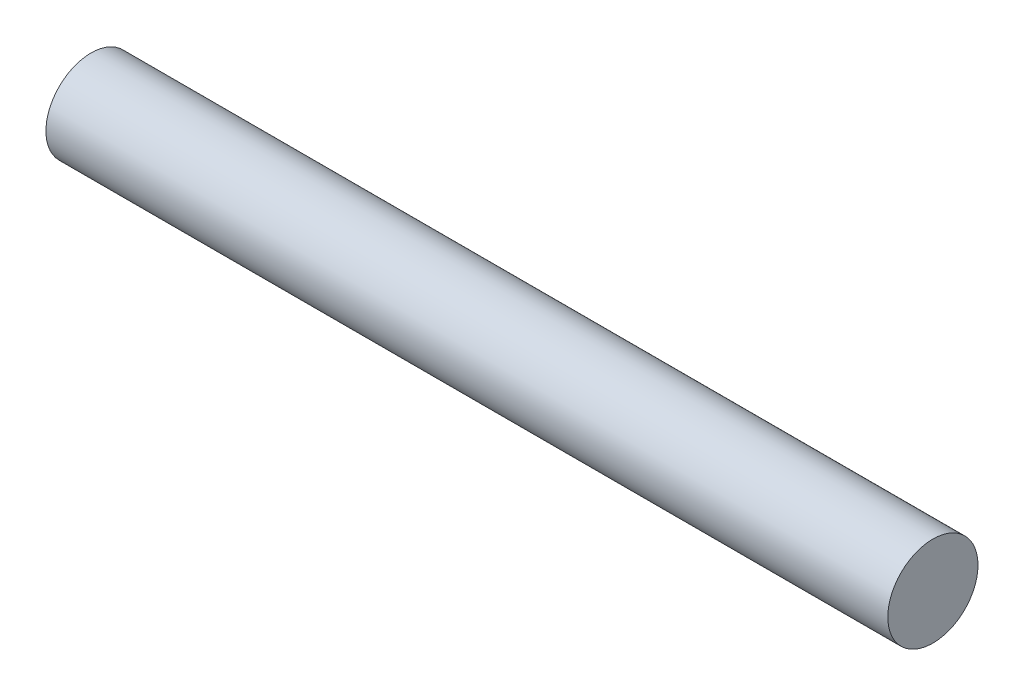
ISO-10303-21;
HEADER;
FILE_DESCRIPTION(('STEP AP214'),'2;1');
FILE_NAME('part.step','',(''),(''),'','','');
FILE_SCHEMA(('AUTOMOTIVE_DESIGN { 1 0 10303 214 1 1 1 1 }'));
ENDSEC;
DATA;
#1=APPLICATION_CONTEXT('core data for automotive mechanical design processes');
#2=APPLICATION_PROTOCOL_DEFINITION('international standard','automotive_design',2000,#1);
#3=PRODUCT_CONTEXT('',#1,'mechanical');
#4=PRODUCT('Part','Part','',(#3));
#5=PRODUCT_RELATED_PRODUCT_CATEGORY('part','',(#4));
#6=PRODUCT_DEFINITION_FORMATION('','',#4);
#7=PRODUCT_DEFINITION_CONTEXT('part definition',#1,'design');
#8=PRODUCT_DEFINITION('design','',#6,#7);
#9=PRODUCT_DEFINITION_SHAPE('','',#8);
#10=(LENGTH_UNIT() NAMED_UNIT(*) SI_UNIT(.MILLI.,.METRE.));
#11=(NAMED_UNIT(*) PLANE_ANGLE_UNIT() SI_UNIT($,.RADIAN.));
#12=(NAMED_UNIT(*) SI_UNIT($,.STERADIAN.) SOLID_ANGLE_UNIT());
#13=UNCERTAINTY_MEASURE_WITH_UNIT(LENGTH_MEASURE(1.E-05),#10,'distance_accuracy_value','');
#14=(GEOMETRIC_REPRESENTATION_CONTEXT(3) GLOBAL_UNCERTAINTY_ASSIGNED_CONTEXT((#13)) GLOBAL_UNIT_ASSIGNED_CONTEXT((#10,
#11,#12)) REPRESENTATION_CONTEXT('',''));
#15=CARTESIAN_POINT('',(0.,0.,0.));
#16=DIRECTION('',(0.,0.,1.));
#17=DIRECTION('',(1.,0.,0.));
#18=AXIS2_PLACEMENT_3D('',#15,#16,#17);
#19=CARTESIAN_POINT('',(0.,0.,0.));
#20=DIRECTION('',(1.,0.,0.));
#21=DIRECTION('',(0.,0.,-1.));
#22=AXIS2_PLACEMENT_3D('',#19,#20,#21);
#23=PLANE('',#22);
#24=CARTESIAN_POINT('',(0.,0.,0.));
#25=DIRECTION('',(1.,0.,0.));
#26=DIRECTION('',(0.,0.,-1.));
#27=AXIS2_PLACEMENT_3D('',#24,#25,#26);
#28=CIRCLE('',#27,9.525);
#29=CARTESIAN_POINT('',(0.,0.,-9.525));
#30=VERTEX_POINT('',#29);
#31=EDGE_CURVE('E39',#30,#30,#28,.T.);
#32=ORIENTED_EDGE('',*,*,#31,.F.);
#33=EDGE_LOOP('',(#32));
#34=FACE_BOUND('',#33,.T.);
#35=ADVANCED_FACE('F32',(#34),#23,.F.);
#36=CARTESIAN_POINT('',(177.8,0.,0.));
#37=DIRECTION('',(1.,0.,0.));
#38=DIRECTION('',(0.,0.,-1.));
#39=AXIS2_PLACEMENT_3D('',#36,#37,#38);
#40=PLANE('',#39);
#41=CARTESIAN_POINT('',(177.8,0.,0.));
#42=DIRECTION('',(1.,0.,0.));
#43=DIRECTION('',(0.,0.,-1.));
#44=AXIS2_PLACEMENT_3D('',#41,#42,#43);
#45=CIRCLE('',#44,9.525);
#46=CARTESIAN_POINT('',(177.8,0.,-9.525));
#47=VERTEX_POINT('',#46);
#48=EDGE_CURVE('E11',#47,#47,#45,.T.);
#49=ORIENTED_EDGE('',*,*,#48,.T.);
#50=EDGE_LOOP('',(#49));
#51=FACE_BOUND('',#50,.T.);
#52=ADVANCED_FACE('F46',(#51),#40,.T.);
#53=CARTESIAN_POINT('',(0.,0.,0.));
#54=DIRECTION('',(1.,0.,0.));
#55=DIRECTION('',(0.,0.,-1.));
#56=AXIS2_PLACEMENT_3D('',#53,#54,#55);
#57=CYLINDRICAL_SURFACE('',#56,9.525);
#58=ORIENTED_EDGE('',*,*,#48,.F.);
#59=EDGE_LOOP('',(#58));
#60=FACE_BOUND('',#59,.T.);
#61=ORIENTED_EDGE('',*,*,#31,.T.);
#62=EDGE_LOOP('',(#61));
#63=FACE_BOUND('',#62,.T.);
#64=ADVANCED_FACE('F48',(#60,#63),#57,.T.);
#65=CLOSED_SHELL('',(#35,#52,#64));
#66=MANIFOLD_SOLID_BREP('B2',#65);
#67=ADVANCED_BREP_SHAPE_REPRESENTATION('',(#18,#66),#14);
#68=SHAPE_DEFINITION_REPRESENTATION(#9,#67);
ENDSEC;
END-ISO-10303-21;
